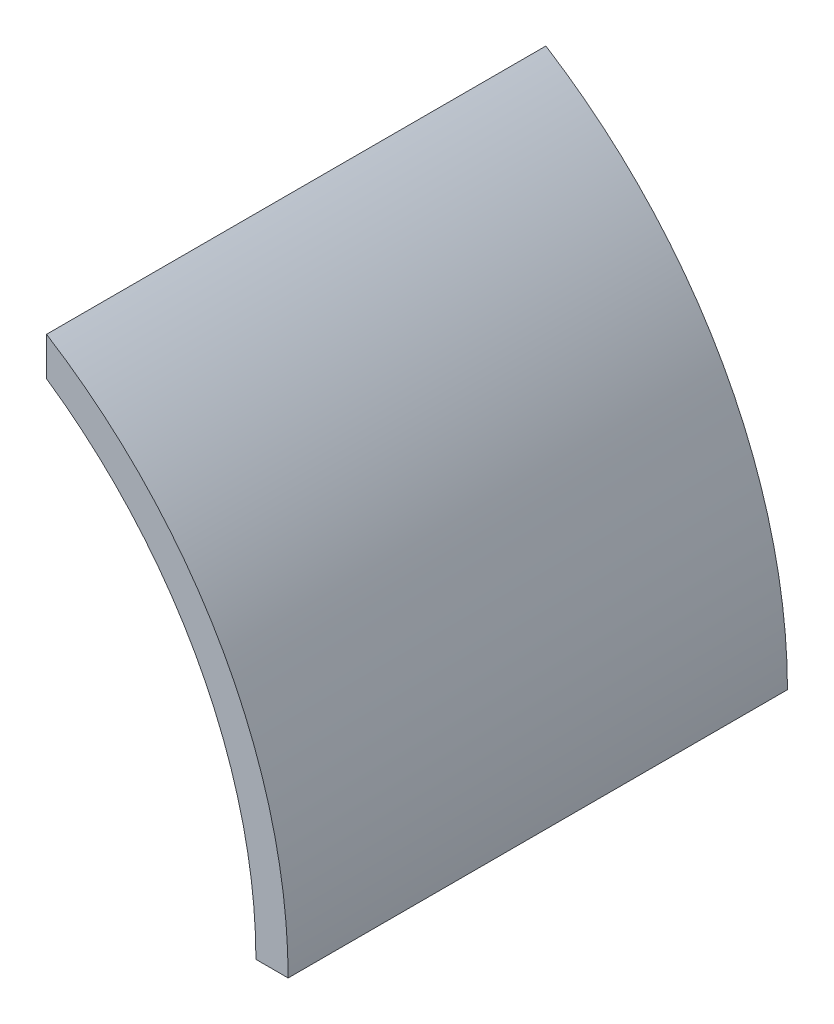
ISO-10303-21;
HEADER;
FILE_DESCRIPTION(('STEP AP214'),'2;1');
FILE_NAME('part.step','',(''),(''),'','','');
FILE_SCHEMA(('AUTOMOTIVE_DESIGN { 1 0 10303 214 1 1 1 1 }'));
ENDSEC;
DATA;
#1=APPLICATION_CONTEXT('core data for automotive mechanical design processes');
#2=APPLICATION_PROTOCOL_DEFINITION('international standard','automotive_design',2000,#1);
#3=PRODUCT_CONTEXT('',#1,'mechanical');
#4=PRODUCT('Part','Part','',(#3));
#5=PRODUCT_RELATED_PRODUCT_CATEGORY('part','',(#4));
#6=PRODUCT_DEFINITION_FORMATION('','',#4);
#7=PRODUCT_DEFINITION_CONTEXT('part definition',#1,'design');
#8=PRODUCT_DEFINITION('design','',#6,#7);
#9=PRODUCT_DEFINITION_SHAPE('','',#8);
#10=(LENGTH_UNIT() NAMED_UNIT(*) SI_UNIT(.MILLI.,.METRE.));
#11=(NAMED_UNIT(*) PLANE_ANGLE_UNIT() SI_UNIT($,.RADIAN.));
#12=(NAMED_UNIT(*) SI_UNIT($,.STERADIAN.) SOLID_ANGLE_UNIT());
#13=UNCERTAINTY_MEASURE_WITH_UNIT(LENGTH_MEASURE(1.E-05),#10,'distance_accuracy_value','');
#14=(GEOMETRIC_REPRESENTATION_CONTEXT(3) GLOBAL_UNCERTAINTY_ASSIGNED_CONTEXT((#13)) GLOBAL_UNIT_ASSIGNED_CONTEXT((#10,
#11,#12)) REPRESENTATION_CONTEXT('',''));
#15=CARTESIAN_POINT('',(0.,0.,0.));
#16=DIRECTION('',(0.,0.,1.));
#17=DIRECTION('',(1.,0.,0.));
#18=AXIS2_PLACEMENT_3D('',#15,#16,#17);
#19=CARTESIAN_POINT('',(0.,0.,155.));
#20=DIRECTION('',(0.,0.,-1.));
#21=DIRECTION('',(-1.,0.,0.));
#22=AXIS2_PLACEMENT_3D('',#19,#20,#21);
#23=CYLINDRICAL_SURFACE('',#22,150.);
#24=CARTESIAN_POINT('',(0.,0.,0.));
#25=DIRECTION('',(0.,0.,-1.));
#26=DIRECTION('',(-1.,0.,0.));
#27=AXIS2_PLACEMENT_3D('',#24,#25,#26);
#28=CIRCLE('',#27,150.);
#29=CARTESIAN_POINT('',(85.,123.592070943083,0.));
#30=VERTEX_POINT('',#29);
#31=CARTESIAN_POINT('',(150.,0.,0.));
#32=VERTEX_POINT('',#31);
#33=EDGE_CURVE('E107',#30,#32,#28,.T.);
#34=ORIENTED_EDGE('',*,*,#33,.T.);
#35=DIRECTION('',(0.,0.,-1.));
#36=VECTOR('',#35,1.);
#37=CARTESIAN_POINT('',(150.,0.,155.));
#38=LINE('',#37,#36);
#39=CARTESIAN_POINT('',(150.,0.,155.));
#40=VERTEX_POINT('',#39);
#41=EDGE_CURVE('E11',#40,#32,#38,.T.);
#42=ORIENTED_EDGE('',*,*,#41,.F.);
#43=CARTESIAN_POINT('',(0.,0.,155.));
#44=DIRECTION('',(0.,0.,-1.));
#45=DIRECTION('',(-1.,0.,0.));
#46=AXIS2_PLACEMENT_3D('',#43,#44,#45);
#47=CIRCLE('',#46,150.);
#48=CARTESIAN_POINT('',(85.,123.592070943083,155.));
#49=VERTEX_POINT('',#48);
#50=EDGE_CURVE('E91',#49,#40,#47,.T.);
#51=ORIENTED_EDGE('',*,*,#50,.F.);
#52=DIRECTION('',(0.,0.,-1.));
#53=VECTOR('',#52,1.);
#54=CARTESIAN_POINT('',(85.,123.592070943083,155.));
#55=LINE('',#54,#53);
#56=EDGE_CURVE('E103',#49,#30,#55,.T.);
#57=ORIENTED_EDGE('',*,*,#56,.T.);
#58=EDGE_LOOP('',(#34,#42,#51,#57));
#59=FACE_BOUND('',#58,.T.);
#60=ADVANCED_FACE('F39',(#59),#23,.F.);
#61=CARTESIAN_POINT('',(150.,0.,155.));
#62=DIRECTION('',(0.,1.,0.));
#63=DIRECTION('',(-1.,0.,0.));
#64=AXIS2_PLACEMENT_3D('',#61,#62,#63);
#65=PLANE('',#64);
#66=DIRECTION('',(1.,0.,0.));
#67=VECTOR('',#66,1.);
#68=CARTESIAN_POINT('',(150.,0.,0.));
#69=LINE('',#68,#67);
#70=CARTESIAN_POINT('',(160.,0.,0.));
#71=VERTEX_POINT('',#70);
#72=EDGE_CURVE('E96',#32,#71,#69,.T.);
#73=ORIENTED_EDGE('',*,*,#72,.T.);
#74=DIRECTION('',(0.,0.,-1.));
#75=VECTOR('',#74,1.);
#76=CARTESIAN_POINT('',(160.,0.,155.));
#77=LINE('',#76,#75);
#78=CARTESIAN_POINT('',(160.,0.,155.));
#79=VERTEX_POINT('',#78);
#80=EDGE_CURVE('E48',#79,#71,#77,.T.);
#81=ORIENTED_EDGE('',*,*,#80,.F.);
#82=DIRECTION('',(1.,0.,0.));
#83=VECTOR('',#82,1.);
#84=CARTESIAN_POINT('',(150.,0.,155.));
#85=LINE('',#84,#83);
#86=EDGE_CURVE('E86',#40,#79,#85,.T.);
#87=ORIENTED_EDGE('',*,*,#86,.F.);
#88=ORIENTED_EDGE('',*,*,#41,.T.);
#89=EDGE_LOOP('',(#73,#81,#87,#88));
#90=FACE_BOUND('',#89,.T.);
#91=ADVANCED_FACE('F95',(#90),#65,.F.);
#92=CARTESIAN_POINT('',(0.,0.,155.));
#93=DIRECTION('',(0.,0.,-1.));
#94=DIRECTION('',(-1.,0.,0.));
#95=AXIS2_PLACEMENT_3D('',#92,#93,#94);
#96=CYLINDRICAL_SURFACE('',#95,160.);
#97=CARTESIAN_POINT('',(0.,0.,0.));
#98=DIRECTION('',(0.,0.,1.));
#99=DIRECTION('',(1.,0.,0.));
#100=AXIS2_PLACEMENT_3D('',#97,#98,#99);
#101=CIRCLE('',#100,160.);
#102=CARTESIAN_POINT('',(85.,135.55441711726,0.));
#103=VERTEX_POINT('',#102);
#104=EDGE_CURVE('E73',#71,#103,#101,.T.);
#105=ORIENTED_EDGE('',*,*,#104,.T.);
#106=DIRECTION('',(0.,0.,-1.));
#107=VECTOR('',#106,1.);
#108=CARTESIAN_POINT('',(85.,135.55441711726,155.));
#109=LINE('',#108,#107);
#110=CARTESIAN_POINT('',(85.,135.55441711726,155.));
#111=VERTEX_POINT('',#110);
#112=EDGE_CURVE('E98',#111,#103,#109,.T.);
#113=ORIENTED_EDGE('',*,*,#112,.F.);
#114=CARTESIAN_POINT('',(0.,0.,155.));
#115=DIRECTION('',(0.,0.,1.));
#116=DIRECTION('',(1.,0.,0.));
#117=AXIS2_PLACEMENT_3D('',#114,#115,#116);
#118=CIRCLE('',#117,160.);
#119=EDGE_CURVE('E89',#79,#111,#118,.T.);
#120=ORIENTED_EDGE('',*,*,#119,.F.);
#121=ORIENTED_EDGE('',*,*,#80,.T.);
#122=EDGE_LOOP('',(#105,#113,#120,#121));
#123=FACE_BOUND('',#122,.T.);
#124=ADVANCED_FACE('F99',(#123),#96,.T.);
#125=CARTESIAN_POINT('',(85.,135.55441711726,155.));
#126=DIRECTION('',(1.,0.,0.));
#127=DIRECTION('',(0.,0.,-1.));
#128=AXIS2_PLACEMENT_3D('',#125,#126,#127);
#129=PLANE('',#128);
#130=DIRECTION('',(0.,-1.,0.));
#131=VECTOR('',#130,1.);
#132=CARTESIAN_POINT('',(85.,135.55441711726,0.));
#133=LINE('',#132,#131);
#134=EDGE_CURVE('E79',#103,#30,#133,.T.);
#135=ORIENTED_EDGE('',*,*,#134,.T.);
#136=ORIENTED_EDGE('',*,*,#56,.F.);
#137=DIRECTION('',(0.,-1.,0.));
#138=VECTOR('',#137,1.);
#139=CARTESIAN_POINT('',(85.,135.55441711726,155.));
#140=LINE('',#139,#138);
#141=EDGE_CURVE('E56',#111,#49,#140,.T.);
#142=ORIENTED_EDGE('',*,*,#141,.F.);
#143=ORIENTED_EDGE('',*,*,#112,.T.);
#144=EDGE_LOOP('',(#135,#136,#142,#143));
#145=FACE_BOUND('',#144,.T.);
#146=ADVANCED_FACE('F120',(#145),#129,.F.);
#147=CARTESIAN_POINT('',(0.,0.,155.));
#148=DIRECTION('',(0.,0.,-1.));
#149=DIRECTION('',(-1.,0.,0.));
#150=AXIS2_PLACEMENT_3D('',#147,#148,#149);
#151=PLANE('',#150);
#152=ORIENTED_EDGE('',*,*,#50,.T.);
#153=ORIENTED_EDGE('',*,*,#86,.T.);
#154=ORIENTED_EDGE('',*,*,#119,.T.);
#155=ORIENTED_EDGE('',*,*,#141,.T.);
#156=EDGE_LOOP('',(#152,#153,#154,#155));
#157=FACE_BOUND('',#156,.T.);
#158=ADVANCED_FACE('F87',(#157),#151,.F.);
#159=CARTESIAN_POINT('',(0.,0.,0.));
#160=DIRECTION('',(0.,0.,-1.));
#161=DIRECTION('',(-1.,0.,0.));
#162=AXIS2_PLACEMENT_3D('',#159,#160,#161);
#163=PLANE('',#162);
#164=ORIENTED_EDGE('',*,*,#33,.F.);
#165=ORIENTED_EDGE('',*,*,#134,.F.);
#166=ORIENTED_EDGE('',*,*,#104,.F.);
#167=ORIENTED_EDGE('',*,*,#72,.F.);
#168=EDGE_LOOP('',(#164,#165,#166,#167));
#169=FACE_BOUND('',#168,.T.);
#170=ADVANCED_FACE('F123',(#169),#163,.T.);
#171=CLOSED_SHELL('',(#60,#91,#124,#146,#158,#170));
#172=MANIFOLD_SOLID_BREP('B2',#171);
#173=ADVANCED_BREP_SHAPE_REPRESENTATION('',(#18,#172),#14);
#174=SHAPE_DEFINITION_REPRESENTATION(#9,#173);
ENDSEC;
END-ISO-10303-21;
